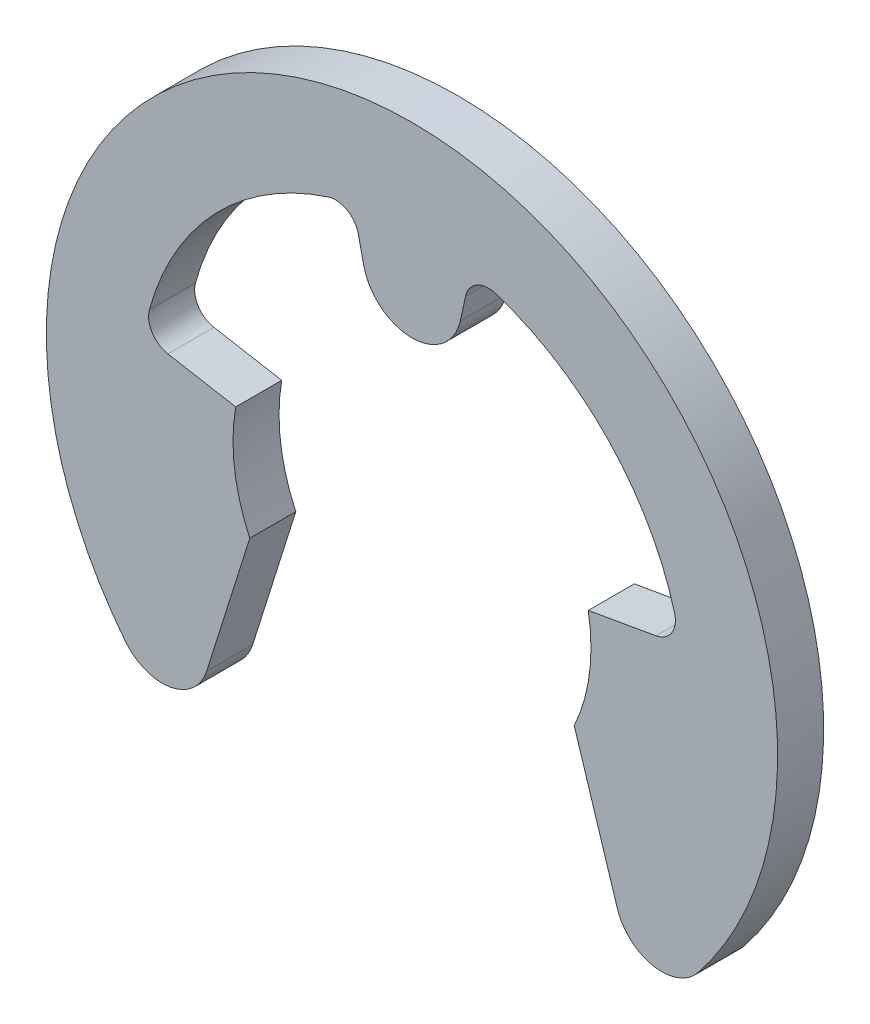
ISO-10303-21;
HEADER;
FILE_DESCRIPTION(('STEP AP214'),'2;1');
FILE_NAME('part.step','',(''),(''),'','','');
FILE_SCHEMA(('AUTOMOTIVE_DESIGN { 1 0 10303 214 1 1 1 1 }'));
ENDSEC;
DATA;
#1=APPLICATION_CONTEXT('core data for automotive mechanical design processes');
#2=APPLICATION_PROTOCOL_DEFINITION('international standard','automotive_design',2000,#1);
#3=PRODUCT_CONTEXT('',#1,'mechanical');
#4=PRODUCT('Part','Part','',(#3));
#5=PRODUCT_RELATED_PRODUCT_CATEGORY('part','',(#4));
#6=PRODUCT_DEFINITION_FORMATION('','',#4);
#7=PRODUCT_DEFINITION_CONTEXT('part definition',#1,'design');
#8=PRODUCT_DEFINITION('design','',#6,#7);
#9=PRODUCT_DEFINITION_SHAPE('','',#8);
#10=(LENGTH_UNIT() NAMED_UNIT(*) SI_UNIT(.MILLI.,.METRE.));
#11=(NAMED_UNIT(*) PLANE_ANGLE_UNIT() SI_UNIT($,.RADIAN.));
#12=(NAMED_UNIT(*) SI_UNIT($,.STERADIAN.) SOLID_ANGLE_UNIT());
#13=UNCERTAINTY_MEASURE_WITH_UNIT(LENGTH_MEASURE(1.E-05),#10,'distance_accuracy_value','');
#14=(GEOMETRIC_REPRESENTATION_CONTEXT(3) GLOBAL_UNCERTAINTY_ASSIGNED_CONTEXT((#13)) GLOBAL_UNIT_ASSIGNED_CONTEXT((#10,
#11,#12)) REPRESENTATION_CONTEXT('',''));
#15=CARTESIAN_POINT('',(0.,0.,0.));
#16=DIRECTION('',(0.,0.,1.));
#17=DIRECTION('',(1.,0.,0.));
#18=AXIS2_PLACEMENT_3D('',#15,#16,#17);
#19=CARTESIAN_POINT('',(0.,0.,-0.9));
#20=DIRECTION('',(0.,0.,1.));
#21=DIRECTION('',(1.,0.,0.));
#22=AXIS2_PLACEMENT_3D('',#19,#20,#21);
#23=CYLINDRICAL_SURFACE('',#22,3.5);
#24=CARTESIAN_POINT('',(0.,0.,0.));
#25=DIRECTION('',(0.,0.,-1.));
#26=DIRECTION('',(1.,0.,0.));
#27=AXIS2_PLACEMENT_3D('',#24,#25,#26);
#28=CIRCLE('',#27,3.5);
#29=CARTESIAN_POINT('',(3.44682713554273,0.607768621834246,0.));
#30=VERTEX_POINT('',#29);
#31=CARTESIAN_POINT('',(3.17207725462827,-1.47916391609246,0.));
#32=VERTEX_POINT('',#31);
#33=EDGE_CURVE('E191',#30,#32,#28,.T.);
#34=ORIENTED_EDGE('',*,*,#33,.F.);
#35=DIRECTION('',(0.,0.,1.));
#36=VECTOR('',#35,1.);
#37=CARTESIAN_POINT('',(3.44682713554273,0.607768621834246,-0.9));
#38=LINE('',#37,#36);
#39=CARTESIAN_POINT('',(3.44682713554273,0.607768621834246,-0.9));
#40=VERTEX_POINT('',#39);
#41=EDGE_CURVE('E11',#40,#30,#38,.T.);
#42=ORIENTED_EDGE('',*,*,#41,.F.);
#43=CARTESIAN_POINT('',(0.,0.,-0.9));
#44=DIRECTION('',(0.,0.,-1.));
#45=DIRECTION('',(1.,0.,0.));
#46=AXIS2_PLACEMENT_3D('',#43,#44,#45);
#47=CIRCLE('',#46,3.5);
#48=CARTESIAN_POINT('',(3.17207725462827,-1.47916391609246,-0.9));
#49=VERTEX_POINT('',#48);
#50=EDGE_CURVE('E241',#40,#49,#47,.T.);
#51=ORIENTED_EDGE('',*,*,#50,.T.);
#52=DIRECTION('',(0.,0.,1.));
#53=VECTOR('',#52,1.);
#54=CARTESIAN_POINT('',(3.17207725462827,-1.47916391609246,-0.9));
#55=LINE('',#54,#53);
#56=EDGE_CURVE('E37',#49,#32,#55,.T.);
#57=ORIENTED_EDGE('',*,*,#56,.T.);
#58=EDGE_LOOP('',(#34,#42,#51,#57));
#59=FACE_BOUND('',#58,.T.);
#60=ADVANCED_FACE('F34',(#59),#23,.F.);
#61=CARTESIAN_POINT('',(3.44682713554273,0.607768621834246,-0.9));
#62=DIRECTION('',(-0.173648177666928,0.984807753012208,0.));
#63=DIRECTION('',(-0.984807753012209,-0.173648177666928,0.));
#64=AXIS2_PLACEMENT_3D('',#61,#62,#63);
#65=PLANE('',#64);
#66=DIRECTION('',(-0.984807753012208,-0.173648177666928,0.));
#67=VECTOR('',#66,1.);
#68=CARTESIAN_POINT('',(3.44682713554273,0.607768621834246,0.));
#69=LINE('',#68,#67);
#70=CARTESIAN_POINT('',(4.7736835303089,0.84172920375708,0.));
#71=VERTEX_POINT('',#70);
#72=EDGE_CURVE('E239',#71,#30,#69,.T.);
#73=ORIENTED_EDGE('',*,*,#72,.F.);
#74=DIRECTION('',(0.,0.,1.));
#75=VECTOR('',#74,1.);
#76=CARTESIAN_POINT('',(4.7736835303089,0.84172920375708,-0.9));
#77=LINE('',#76,#75);
#78=CARTESIAN_POINT('',(4.7736835303089,0.84172920375708,-0.9));
#79=VERTEX_POINT('',#78);
#80=EDGE_CURVE('E43',#79,#71,#77,.T.);
#81=ORIENTED_EDGE('',*,*,#80,.F.);
#82=DIRECTION('',(-0.984807753012208,-0.173648177666928,0.));
#83=VECTOR('',#82,1.);
#84=CARTESIAN_POINT('',(3.44682713554273,0.607768621834246,-0.9));
#85=LINE('',#84,#83);
#86=EDGE_CURVE('E181',#79,#40,#85,.T.);
#87=ORIENTED_EDGE('',*,*,#86,.T.);
#88=ORIENTED_EDGE('',*,*,#41,.T.);
#89=EDGE_LOOP('',(#73,#81,#87,#88));
#90=FACE_BOUND('',#89,.T.);
#91=ADVANCED_FACE('F273',(#90),#65,.T.);
#92=CARTESIAN_POINT('',(4.69445654924837,1.2910477410689,-0.9));
#93=DIRECTION('',(0.,0.,1.));
#94=DIRECTION('',(1.,0.,0.));
#95=AXIS2_PLACEMENT_3D('',#92,#93,#94);
#96=CYLINDRICAL_SURFACE('',#95,0.456250000000001);
#97=CARTESIAN_POINT('',(4.69445654924837,1.2910477410689,0.));
#98=DIRECTION('',(0.,0.,-1.));
#99=DIRECTION('',(1.,0.,0.));
#100=AXIS2_PLACEMENT_3D('',#97,#98,#99);
#101=CIRCLE('',#100,0.456250000000001);
#102=CARTESIAN_POINT('',(5.13437353011503,1.41203167572619,0.));
#103=VERTEX_POINT('',#102);
#104=EDGE_CURVE('E168',#103,#71,#101,.T.);
#105=ORIENTED_EDGE('',*,*,#104,.F.);
#106=DIRECTION('',(0.,0.,1.));
#107=VECTOR('',#106,1.);
#108=CARTESIAN_POINT('',(5.13437353011503,1.41203167572619,-0.9));
#109=LINE('',#108,#107);
#110=CARTESIAN_POINT('',(5.13437353011503,1.41203167572619,-0.9));
#111=VERTEX_POINT('',#110);
#112=EDGE_CURVE('E163',#111,#103,#109,.T.);
#113=ORIENTED_EDGE('',*,*,#112,.F.);
#114=CARTESIAN_POINT('',(4.69445654924837,1.2910477410689,-0.9));
#115=DIRECTION('',(0.,0.,-1.));
#116=DIRECTION('',(1.,0.,0.));
#117=AXIS2_PLACEMENT_3D('',#114,#115,#116);
#118=CIRCLE('',#117,0.456250000000001);
#119=EDGE_CURVE('E166',#111,#79,#118,.T.);
#120=ORIENTED_EDGE('',*,*,#119,.T.);
#121=ORIENTED_EDGE('',*,*,#80,.T.);
#122=EDGE_LOOP('',(#105,#113,#120,#121));
#123=FACE_BOUND('',#122,.T.);
#124=ADVANCED_FACE('F165',(#123),#96,.F.);
#125=CARTESIAN_POINT('',(0.,0.,-0.9));
#126=DIRECTION('',(0.,0.,1.));
#127=DIRECTION('',(1.,0.,0.));
#128=AXIS2_PLACEMENT_3D('',#125,#126,#127);
#129=CYLINDRICAL_SURFACE('',#128,5.325);
#130=CARTESIAN_POINT('',(0.,0.,0.));
#131=DIRECTION('',(0.,0.,-1.));
#132=DIRECTION('',(1.,0.,0.));
#133=AXIS2_PLACEMENT_3D('',#130,#131,#132);
#134=CIRCLE('',#133,5.325);
#135=CARTESIAN_POINT('',(1.63464596233994,5.06789478756276,0.));
#136=VERTEX_POINT('',#135);
#137=EDGE_CURVE('E236',#136,#103,#134,.T.);
#138=ORIENTED_EDGE('',*,*,#137,.F.);
#139=DIRECTION('',(0.,0.,1.));
#140=VECTOR('',#139,1.);
#141=CARTESIAN_POINT('',(1.63464596233994,5.06789478756276,-0.9));
#142=LINE('',#141,#140);
#143=CARTESIAN_POINT('',(1.63464596233994,5.06789478756276,-0.9));
#144=VERTEX_POINT('',#143);
#145=EDGE_CURVE('E173',#144,#136,#142,.T.);
#146=ORIENTED_EDGE('',*,*,#145,.F.);
#147=CARTESIAN_POINT('',(0.,0.,-0.9));
#148=DIRECTION('',(0.,0.,-1.));
#149=DIRECTION('',(1.,0.,0.));
#150=AXIS2_PLACEMENT_3D('',#147,#148,#149);
#151=CIRCLE('',#150,5.325);
#152=EDGE_CURVE('E179',#144,#111,#151,.T.);
#153=ORIENTED_EDGE('',*,*,#152,.T.);
#154=ORIENTED_EDGE('',*,*,#112,.T.);
#155=EDGE_LOOP('',(#138,#146,#153,#154));
#156=FACE_BOUND('',#155,.T.);
#157=ADVANCED_FACE('F183',(#156),#129,.F.);
#158=CARTESIAN_POINT('',(1.49458826838358,4.63367375529505,-0.9));
#159=DIRECTION('',(0.,0.,1.));
#160=DIRECTION('',(1.,0.,0.));
#161=AXIS2_PLACEMENT_3D('',#158,#159,#160);
#162=CYLINDRICAL_SURFACE('',#161,0.45625);
#163=CARTESIAN_POINT('',(1.49458826838358,4.63367375529505,0.));
#164=DIRECTION('',(0.,0.,-1.));
#165=DIRECTION('',(1.,0.,0.));
#166=AXIS2_PLACEMENT_3D('',#163,#164,#165);
#167=CIRCLE('',#166,0.45625);
#168=CARTESIAN_POINT('',(1.04915321513511,4.73242432915431,0.));
#169=VERTEX_POINT('',#168);
#170=EDGE_CURVE('E233',#169,#136,#167,.T.);
#171=ORIENTED_EDGE('',*,*,#170,.F.);
#172=DIRECTION('',(0.,0.,1.));
#173=VECTOR('',#172,1.);
#174=CARTESIAN_POINT('',(1.04915321513511,4.73242432915431,-0.9));
#175=LINE('',#174,#173);
#176=CARTESIAN_POINT('',(1.04915321513511,4.73242432915431,-0.9));
#177=VERTEX_POINT('',#176);
#178=EDGE_CURVE('E245',#177,#169,#175,.T.);
#179=ORIENTED_EDGE('',*,*,#178,.F.);
#180=CARTESIAN_POINT('',(1.49458826838358,4.63367375529505,-0.9));
#181=DIRECTION('',(0.,0.,-1.));
#182=DIRECTION('',(1.,0.,0.));
#183=AXIS2_PLACEMENT_3D('',#180,#181,#182);
#184=CIRCLE('',#183,0.45625);
#185=EDGE_CURVE('E184',#177,#144,#184,.T.);
#186=ORIENTED_EDGE('',*,*,#185,.T.);
#187=ORIENTED_EDGE('',*,*,#145,.T.);
#188=EDGE_LOOP('',(#171,#179,#186,#187));
#189=FACE_BOUND('',#188,.T.);
#190=ADVANCED_FACE('F286',(#189),#162,.F.);
#191=CARTESIAN_POINT('',(0.943873594431308,4.25753864878336,-0.9));
#192=DIRECTION('',(0.976296007119933,-0.216439613938104,0.));
#193=DIRECTION('',(0.216439613938104,0.976296007119933,0.));
#194=AXIS2_PLACEMENT_3D('',#191,#192,#193);
#195=PLANE('',#194);
#196=DIRECTION('',(0.216439613938104,0.976296007119933,0.));
#197=VECTOR('',#196,1.);
#198=CARTESIAN_POINT('',(0.943873594431308,4.25753864878336,0.));
#199=LINE('',#198,#197);
#200=CARTESIAN_POINT('',(0.943873594431308,4.25753864878336,0.));
#201=VERTEX_POINT('',#200);
#202=EDGE_CURVE('E230',#201,#169,#199,.T.);
#203=ORIENTED_EDGE('',*,*,#202,.F.);
#204=DIRECTION('',(0.,0.,1.));
#205=VECTOR('',#204,1.);
#206=CARTESIAN_POINT('',(0.943873594431308,4.25753864878336,-0.9));
#207=LINE('',#206,#205);
#208=CARTESIAN_POINT('',(0.943873594431308,4.25753864878336,-0.9));
#209=VERTEX_POINT('',#208);
#210=EDGE_CURVE('E247',#209,#201,#207,.T.);
#211=ORIENTED_EDGE('',*,*,#210,.F.);
#212=DIRECTION('',(0.216439613938104,0.976296007119933,0.));
#213=VECTOR('',#212,1.);
#214=CARTESIAN_POINT('',(0.943873594431308,4.25753864878336,-0.9));
#215=LINE('',#214,#213);
#216=EDGE_CURVE('E186',#209,#177,#215,.T.);
#217=ORIENTED_EDGE('',*,*,#216,.T.);
#218=ORIENTED_EDGE('',*,*,#178,.T.);
#219=EDGE_LOOP('',(#203,#211,#217,#218));
#220=FACE_BOUND('',#219,.T.);
#221=ADVANCED_FACE('F289',(#220),#195,.T.);
#222=CARTESIAN_POINT('',(0.,4.46679038687838,-0.9));
#223=DIRECTION('',(0.,0.,1.));
#224=DIRECTION('',(1.,0.,0.));
#225=AXIS2_PLACEMENT_3D('',#222,#223,#224);
#226=CYLINDRICAL_SURFACE('',#225,0.96679038687839);
#227=CARTESIAN_POINT('',(0.,4.46679038687838,0.));
#228=DIRECTION('',(0.,0.,1.));
#229=DIRECTION('',(1.,0.,0.));
#230=AXIS2_PLACEMENT_3D('',#227,#228,#229);
#231=CIRCLE('',#230,0.96679038687839);
#232=CARTESIAN_POINT('',(-0.943873594431308,4.25753864878336,0.));
#233=VERTEX_POINT('',#232);
#234=EDGE_CURVE('E227',#233,#201,#231,.T.);
#235=ORIENTED_EDGE('',*,*,#234,.F.);
#236=DIRECTION('',(0.,0.,1.));
#237=VECTOR('',#236,1.);
#238=CARTESIAN_POINT('',(-0.943873594431308,4.25753864878336,-0.9));
#239=LINE('',#238,#237);
#240=CARTESIAN_POINT('',(-0.943873594431308,4.25753864878336,-0.9));
#241=VERTEX_POINT('',#240);
#242=EDGE_CURVE('E249',#241,#233,#239,.T.);
#243=ORIENTED_EDGE('',*,*,#242,.F.);
#244=CARTESIAN_POINT('',(0.,4.46679038687838,-0.9));
#245=DIRECTION('',(0.,0.,1.));
#246=DIRECTION('',(1.,0.,0.));
#247=AXIS2_PLACEMENT_3D('',#244,#245,#246);
#248=CIRCLE('',#247,0.96679038687839);
#249=EDGE_CURVE('E497',#241,#209,#248,.T.);
#250=ORIENTED_EDGE('',*,*,#249,.T.);
#251=ORIENTED_EDGE('',*,*,#210,.T.);
#252=EDGE_LOOP('',(#235,#243,#250,#251));
#253=FACE_BOUND('',#252,.T.);
#254=ADVANCED_FACE('F293',(#253),#226,.T.);
#255=CARTESIAN_POINT('',(-0.943873594431308,4.25753864878336,-0.9));
#256=DIRECTION('',(-0.976296007119933,-0.216439613938104,0.));
#257=DIRECTION('',(0.216439613938104,-0.976296007119933,0.));
#258=AXIS2_PLACEMENT_3D('',#255,#256,#257);
#259=PLANE('',#258);
#260=DIRECTION('',(0.216439613938104,-0.976296007119933,0.));
#261=VECTOR('',#260,1.);
#262=CARTESIAN_POINT('',(-0.943873594431308,4.25753864878336,0.));
#263=LINE('',#262,#261);
#264=CARTESIAN_POINT('',(-1.04915321513511,4.73242432915431,0.));
#265=VERTEX_POINT('',#264);
#266=EDGE_CURVE('E224',#265,#233,#263,.T.);
#267=ORIENTED_EDGE('',*,*,#266,.F.);
#268=DIRECTION('',(0.,0.,1.));
#269=VECTOR('',#268,1.);
#270=CARTESIAN_POINT('',(-1.04915321513511,4.73242432915431,-0.9));
#271=LINE('',#270,#269);
#272=CARTESIAN_POINT('',(-1.04915321513511,4.73242432915431,-0.9));
#273=VERTEX_POINT('',#272);
#274=EDGE_CURVE('E251',#273,#265,#271,.T.);
#275=ORIENTED_EDGE('',*,*,#274,.F.);
#276=DIRECTION('',(0.216439613938104,-0.976296007119933,0.));
#277=VECTOR('',#276,1.);
#278=CARTESIAN_POINT('',(-0.943873594431308,4.25753864878336,-0.9));
#279=LINE('',#278,#277);
#280=EDGE_CURVE('E501',#273,#241,#279,.T.);
#281=ORIENTED_EDGE('',*,*,#280,.T.);
#282=ORIENTED_EDGE('',*,*,#242,.T.);
#283=EDGE_LOOP('',(#267,#275,#281,#282));
#284=FACE_BOUND('',#283,.T.);
#285=ADVANCED_FACE('F297',(#284),#259,.T.);
#286=CARTESIAN_POINT('',(-1.49458826838358,4.63367375529505,-0.9));
#287=DIRECTION('',(0.,0.,1.));
#288=DIRECTION('',(1.,0.,0.));
#289=AXIS2_PLACEMENT_3D('',#286,#287,#288);
#290=CYLINDRICAL_SURFACE('',#289,0.45625);
#291=CARTESIAN_POINT('',(-1.49458826838358,4.63367375529505,0.));
#292=DIRECTION('',(0.,0.,-1.));
#293=DIRECTION('',(1.,0.,0.));
#294=AXIS2_PLACEMENT_3D('',#291,#292,#293);
#295=CIRCLE('',#294,0.45625);
#296=CARTESIAN_POINT('',(-1.63464596233994,5.06789478756276,0.));
#297=VERTEX_POINT('',#296);
#298=EDGE_CURVE('E221',#297,#265,#295,.T.);
#299=ORIENTED_EDGE('',*,*,#298,.F.);
#300=DIRECTION('',(0.,0.,1.));
#301=VECTOR('',#300,1.);
#302=CARTESIAN_POINT('',(-1.63464596233994,5.06789478756276,-0.9));
#303=LINE('',#302,#301);
#304=CARTESIAN_POINT('',(-1.63464596233994,5.06789478756276,-0.9));
#305=VERTEX_POINT('',#304);
#306=EDGE_CURVE('E253',#305,#297,#303,.T.);
#307=ORIENTED_EDGE('',*,*,#306,.F.);
#308=CARTESIAN_POINT('',(-1.49458826838358,4.63367375529505,-0.9));
#309=DIRECTION('',(0.,0.,-1.));
#310=DIRECTION('',(1.,0.,0.));
#311=AXIS2_PLACEMENT_3D('',#308,#309,#310);
#312=CIRCLE('',#311,0.45625);
#313=EDGE_CURVE('E490',#305,#273,#312,.T.);
#314=ORIENTED_EDGE('',*,*,#313,.T.);
#315=ORIENTED_EDGE('',*,*,#274,.T.);
#316=EDGE_LOOP('',(#299,#307,#314,#315));
#317=FACE_BOUND('',#316,.T.);
#318=ADVANCED_FACE('F301',(#317),#290,.F.);
#319=CARTESIAN_POINT('',(0.,0.,-0.9));
#320=DIRECTION('',(0.,0.,1.));
#321=DIRECTION('',(1.,0.,0.));
#322=AXIS2_PLACEMENT_3D('',#319,#320,#321);
#323=CYLINDRICAL_SURFACE('',#322,5.325);
#324=CARTESIAN_POINT('',(0.,0.,0.));
#325=DIRECTION('',(0.,0.,-1.));
#326=DIRECTION('',(1.,0.,0.));
#327=AXIS2_PLACEMENT_3D('',#324,#325,#326);
#328=CIRCLE('',#327,5.325);
#329=CARTESIAN_POINT('',(-5.13437353011503,1.41203167572619,0.));
#330=VERTEX_POINT('',#329);
#331=EDGE_CURVE('E218',#330,#297,#328,.T.);
#332=ORIENTED_EDGE('',*,*,#331,.F.);
#333=DIRECTION('',(0.,0.,1.));
#334=VECTOR('',#333,1.);
#335=CARTESIAN_POINT('',(-5.13437353011503,1.41203167572619,-0.9));
#336=LINE('',#335,#334);
#337=CARTESIAN_POINT('',(-5.13437353011503,1.41203167572619,-0.9));
#338=VERTEX_POINT('',#337);
#339=EDGE_CURVE('E255',#338,#330,#336,.T.);
#340=ORIENTED_EDGE('',*,*,#339,.F.);
#341=CARTESIAN_POINT('',(0.,0.,-0.9));
#342=DIRECTION('',(0.,0.,-1.));
#343=DIRECTION('',(1.,0.,0.));
#344=AXIS2_PLACEMENT_3D('',#341,#342,#343);
#345=CIRCLE('',#344,5.325);
#346=EDGE_CURVE('E486',#338,#305,#345,.T.);
#347=ORIENTED_EDGE('',*,*,#346,.T.);
#348=ORIENTED_EDGE('',*,*,#306,.T.);
#349=EDGE_LOOP('',(#332,#340,#347,#348));
#350=FACE_BOUND('',#349,.T.);
#351=ADVANCED_FACE('F305',(#350),#323,.F.);
#352=CARTESIAN_POINT('',(-4.69445654924837,1.2910477410689,-0.9));
#353=DIRECTION('',(0.,0.,1.));
#354=DIRECTION('',(1.,0.,0.));
#355=AXIS2_PLACEMENT_3D('',#352,#353,#354);
#356=CYLINDRICAL_SURFACE('',#355,0.456250000000001);
#357=CARTESIAN_POINT('',(-4.69445654924837,1.2910477410689,0.));
#358=DIRECTION('',(0.,0.,-1.));
#359=DIRECTION('',(1.,0.,0.));
#360=AXIS2_PLACEMENT_3D('',#357,#358,#359);
#361=CIRCLE('',#360,0.456250000000001);
#362=CARTESIAN_POINT('',(-4.7736835303089,0.841729203757079,0.));
#363=VERTEX_POINT('',#362);
#364=EDGE_CURVE('E215',#363,#330,#361,.T.);
#365=ORIENTED_EDGE('',*,*,#364,.F.);
#366=DIRECTION('',(0.,0.,1.));
#367=VECTOR('',#366,1.);
#368=CARTESIAN_POINT('',(-4.7736835303089,0.841729203757079,-0.9));
#369=LINE('',#368,#367);
#370=CARTESIAN_POINT('',(-4.7736835303089,0.841729203757079,-0.9));
#371=VERTEX_POINT('',#370);
#372=EDGE_CURVE('E257',#371,#363,#369,.T.);
#373=ORIENTED_EDGE('',*,*,#372,.F.);
#374=CARTESIAN_POINT('',(-4.69445654924837,1.2910477410689,-0.9));
#375=DIRECTION('',(0.,0.,-1.));
#376=DIRECTION('',(1.,0.,0.));
#377=AXIS2_PLACEMENT_3D('',#374,#375,#376);
#378=CIRCLE('',#377,0.456250000000001);
#379=EDGE_CURVE('E507',#371,#338,#378,.T.);
#380=ORIENTED_EDGE('',*,*,#379,.T.);
#381=ORIENTED_EDGE('',*,*,#339,.T.);
#382=EDGE_LOOP('',(#365,#373,#380,#381));
#383=FACE_BOUND('',#382,.T.);
#384=ADVANCED_FACE('F309',(#383),#356,.F.);
#385=CARTESIAN_POINT('',(-3.44682713554273,0.607768621834246,-0.9));
#386=DIRECTION('',(0.173648177666928,0.984807753012208,0.));
#387=DIRECTION('',(-0.984807753012209,0.173648177666928,0.));
#388=AXIS2_PLACEMENT_3D('',#385,#386,#387);
#389=PLANE('',#388);
#390=DIRECTION('',(-0.984807753012208,0.173648177666928,0.));
#391=VECTOR('',#390,1.);
#392=CARTESIAN_POINT('',(-3.44682713554273,0.607768621834246,0.));
#393=LINE('',#392,#391);
#394=CARTESIAN_POINT('',(-3.44682713554273,0.607768621834246,0.));
#395=VERTEX_POINT('',#394);
#396=EDGE_CURVE('E212',#395,#363,#393,.T.);
#397=ORIENTED_EDGE('',*,*,#396,.F.);
#398=DIRECTION('',(0.,0.,1.));
#399=VECTOR('',#398,1.);
#400=CARTESIAN_POINT('',(-3.44682713554273,0.607768621834246,-0.9));
#401=LINE('',#400,#399);
#402=CARTESIAN_POINT('',(-3.44682713554273,0.607768621834246,-0.9));
#403=VERTEX_POINT('',#402);
#404=EDGE_CURVE('E259',#403,#395,#401,.T.);
#405=ORIENTED_EDGE('',*,*,#404,.F.);
#406=DIRECTION('',(-0.984807753012208,0.173648177666928,0.));
#407=VECTOR('',#406,1.);
#408=CARTESIAN_POINT('',(-3.44682713554273,0.607768621834246,-0.9));
#409=LINE('',#408,#407);
#410=EDGE_CURVE('E479',#403,#371,#409,.T.);
#411=ORIENTED_EDGE('',*,*,#410,.T.);
#412=ORIENTED_EDGE('',*,*,#372,.T.);
#413=EDGE_LOOP('',(#397,#405,#411,#412));
#414=FACE_BOUND('',#413,.T.);
#415=ADVANCED_FACE('F313',(#414),#389,.T.);
#416=CARTESIAN_POINT('',(0.,0.,-0.9));
#417=DIRECTION('',(0.,0.,1.));
#418=DIRECTION('',(1.,0.,0.));
#419=AXIS2_PLACEMENT_3D('',#416,#417,#418);
#420=CYLINDRICAL_SURFACE('',#419,3.5);
#421=CARTESIAN_POINT('',(0.,0.,0.));
#422=DIRECTION('',(0.,0.,-1.));
#423=DIRECTION('',(1.,0.,0.));
#424=AXIS2_PLACEMENT_3D('',#421,#422,#423);
#425=CIRCLE('',#424,3.5);
#426=CARTESIAN_POINT('',(-3.17207725462827,-1.47916391609246,0.));
#427=VERTEX_POINT('',#426);
#428=EDGE_CURVE('E209',#427,#395,#425,.T.);
#429=ORIENTED_EDGE('',*,*,#428,.F.);
#430=DIRECTION('',(0.,0.,1.));
#431=VECTOR('',#430,1.);
#432=CARTESIAN_POINT('',(-3.17207725462827,-1.47916391609246,-0.9));
#433=LINE('',#432,#431);
#434=CARTESIAN_POINT('',(-3.17207725462827,-1.47916391609246,-0.9));
#435=VERTEX_POINT('',#434);
#436=EDGE_CURVE('E261',#435,#427,#433,.T.);
#437=ORIENTED_EDGE('',*,*,#436,.F.);
#438=CARTESIAN_POINT('',(0.,0.,-0.9));
#439=DIRECTION('',(0.,0.,-1.));
#440=DIRECTION('',(1.,0.,0.));
#441=AXIS2_PLACEMENT_3D('',#438,#439,#440);
#442=CIRCLE('',#441,3.5);
#443=EDGE_CURVE('E475',#435,#403,#442,.T.);
#444=ORIENTED_EDGE('',*,*,#443,.T.);
#445=ORIENTED_EDGE('',*,*,#404,.T.);
#446=EDGE_LOOP('',(#429,#437,#444,#445));
#447=FACE_BOUND('',#446,.T.);
#448=ADVANCED_FACE('F317',(#447),#420,.F.);
#449=CARTESIAN_POINT('',(-3.17207725462827,-1.47916391609246,-0.9));
#450=DIRECTION('',(0.953716950748227,-0.300705799504273,0.));
#451=DIRECTION('',(0.300705799504273,0.953716950748227,0.));
#452=AXIS2_PLACEMENT_3D('',#449,#450,#451);
#453=PLANE('',#452);
#454=DIRECTION('',(0.300705799504273,0.953716950748227,0.));
#455=VECTOR('',#454,1.);
#456=CARTESIAN_POINT('',(-3.17207725462827,-1.47916391609246,0.));
#457=LINE('',#456,#455);
#458=CARTESIAN_POINT('',(-4.01500875403962,-4.15260107837372,0.));
#459=VERTEX_POINT('',#458);
#460=EDGE_CURVE('E206',#459,#427,#457,.T.);
#461=ORIENTED_EDGE('',*,*,#460,.F.);
#462=DIRECTION('',(0.,0.,1.));
#463=VECTOR('',#462,1.);
#464=CARTESIAN_POINT('',(-4.01500875403962,-4.15260107837372,-0.9));
#465=LINE('',#464,#463);
#466=CARTESIAN_POINT('',(-4.01500875403962,-4.15260107837372,-0.9));
#467=VERTEX_POINT('',#466);
#468=EDGE_CURVE('E263',#467,#459,#465,.T.);
#469=ORIENTED_EDGE('',*,*,#468,.F.);
#470=DIRECTION('',(0.300705799504273,0.953716950748227,0.));
#471=VECTOR('',#470,1.);
#472=CARTESIAN_POINT('',(-3.17207725462827,-1.47916391609246,-0.9));
#473=LINE('',#472,#471);
#474=EDGE_CURVE('E511',#467,#435,#473,.T.);
#475=ORIENTED_EDGE('',*,*,#474,.T.);
#476=ORIENTED_EDGE('',*,*,#436,.T.);
#477=EDGE_LOOP('',(#461,#469,#475,#476));
#478=FACE_BOUND('',#477,.T.);
#479=ADVANCED_FACE('F321',(#478),#453,.T.);
#480=CARTESIAN_POINT('',(-4.88527547159737,-3.87820703632607,-0.9));
#481=DIRECTION('',(0.,0.,1.));
#482=DIRECTION('',(1.,0.,0.));
#483=AXIS2_PLACEMENT_3D('',#480,#481,#482);
#484=CYLINDRICAL_SURFACE('',#483,0.9125);
#485=CARTESIAN_POINT('',(-4.88527547159737,-3.87820703632607,0.));
#486=DIRECTION('',(0.,0.,1.));
#487=DIRECTION('',(1.,0.,0.));
#488=AXIS2_PLACEMENT_3D('',#485,#486,#487);
#489=CIRCLE('',#488,0.9125);
#490=CARTESIAN_POINT('',(-5.59995504960661,-4.44555996949602,0.));
#491=VERTEX_POINT('',#490);
#492=EDGE_CURVE('E203',#491,#459,#489,.T.);
#493=ORIENTED_EDGE('',*,*,#492,.F.);
#494=DIRECTION('',(0.,0.,1.));
#495=VECTOR('',#494,1.);
#496=CARTESIAN_POINT('',(-5.59995504960661,-4.44555996949602,-0.9));
#497=LINE('',#496,#495);
#498=CARTESIAN_POINT('',(-5.59995504960661,-4.44555996949602,-0.9));
#499=VERTEX_POINT('',#498);
#500=EDGE_CURVE('E265',#499,#491,#497,.T.);
#501=ORIENTED_EDGE('',*,*,#500,.F.);
#502=CARTESIAN_POINT('',(-4.88527547159737,-3.87820703632607,-0.9));
#503=DIRECTION('',(0.,0.,1.));
#504=DIRECTION('',(1.,0.,0.));
#505=AXIS2_PLACEMENT_3D('',#502,#503,#504);
#506=CIRCLE('',#505,0.9125);
#507=EDGE_CURVE('E468',#499,#467,#506,.T.);
#508=ORIENTED_EDGE('',*,*,#507,.T.);
#509=ORIENTED_EDGE('',*,*,#468,.T.);
#510=EDGE_LOOP('',(#493,#501,#508,#509));
#511=FACE_BOUND('',#510,.T.);
#512=ADVANCED_FACE('F325',(#511),#484,.T.);
#513=CARTESIAN_POINT('',(0.,0.,-0.9));
#514=DIRECTION('',(0.,0.,1.));
#515=DIRECTION('',(1.,0.,0.));
#516=AXIS2_PLACEMENT_3D('',#513,#514,#515);
#517=CYLINDRICAL_SURFACE('',#516,7.15);
#518=CARTESIAN_POINT('',(0.,0.,0.));
#519=DIRECTION('',(0.,0.,1.));
#520=DIRECTION('',(1.,0.,0.));
#521=AXIS2_PLACEMENT_3D('',#518,#519,#520);
#522=CIRCLE('',#521,7.15);
#523=CARTESIAN_POINT('',(5.59995504960661,-4.44555996949602,0.));
#524=VERTEX_POINT('',#523);
#525=EDGE_CURVE('E200',#524,#491,#522,.T.);
#526=ORIENTED_EDGE('',*,*,#525,.F.);
#527=DIRECTION('',(0.,0.,1.));
#528=VECTOR('',#527,1.);
#529=CARTESIAN_POINT('',(5.59995504960661,-4.44555996949602,-0.9));
#530=LINE('',#529,#528);
#531=CARTESIAN_POINT('',(5.59995504960661,-4.44555996949602,-0.9));
#532=VERTEX_POINT('',#531);
#533=EDGE_CURVE('E267',#532,#524,#530,.T.);
#534=ORIENTED_EDGE('',*,*,#533,.F.);
#535=CARTESIAN_POINT('',(0.,0.,-0.9));
#536=DIRECTION('',(0.,0.,1.));
#537=DIRECTION('',(1.,0.,0.));
#538=AXIS2_PLACEMENT_3D('',#535,#536,#537);
#539=CIRCLE('',#538,7.15);
#540=EDGE_CURVE('E464',#532,#499,#539,.T.);
#541=ORIENTED_EDGE('',*,*,#540,.T.);
#542=ORIENTED_EDGE('',*,*,#500,.T.);
#543=EDGE_LOOP('',(#526,#534,#541,#542));
#544=FACE_BOUND('',#543,.T.);
#545=ADVANCED_FACE('F329',(#544),#517,.T.);
#546=CARTESIAN_POINT('',(4.88527547159737,-3.87820703632607,-0.9));
#547=DIRECTION('',(0.,0.,1.));
#548=DIRECTION('',(1.,0.,0.));
#549=AXIS2_PLACEMENT_3D('',#546,#547,#548);
#550=CYLINDRICAL_SURFACE('',#549,0.9125);
#551=CARTESIAN_POINT('',(4.88527547159737,-3.87820703632607,0.));
#552=DIRECTION('',(0.,0.,1.));
#553=DIRECTION('',(1.,0.,0.));
#554=AXIS2_PLACEMENT_3D('',#551,#552,#553);
#555=CIRCLE('',#554,0.9125);
#556=CARTESIAN_POINT('',(4.01500875403962,-4.15260107837372,0.));
#557=VERTEX_POINT('',#556);
#558=EDGE_CURVE('E197',#557,#524,#555,.T.);
#559=ORIENTED_EDGE('',*,*,#558,.F.);
#560=DIRECTION('',(0.,0.,1.));
#561=VECTOR('',#560,1.);
#562=CARTESIAN_POINT('',(4.01500875403962,-4.15260107837372,-0.9));
#563=LINE('',#562,#561);
#564=CARTESIAN_POINT('',(4.01500875403962,-4.15260107837372,-0.9));
#565=VERTEX_POINT('',#564);
#566=EDGE_CURVE('E268',#565,#557,#563,.T.);
#567=ORIENTED_EDGE('',*,*,#566,.F.);
#568=CARTESIAN_POINT('',(4.88527547159737,-3.87820703632607,-0.9));
#569=DIRECTION('',(0.,0.,1.));
#570=DIRECTION('',(1.,0.,0.));
#571=AXIS2_PLACEMENT_3D('',#568,#569,#570);
#572=CIRCLE('',#571,0.9125);
#573=EDGE_CURVE('E515',#565,#532,#572,.T.);
#574=ORIENTED_EDGE('',*,*,#573,.T.);
#575=ORIENTED_EDGE('',*,*,#533,.T.);
#576=EDGE_LOOP('',(#559,#567,#574,#575));
#577=FACE_BOUND('',#576,.T.);
#578=ADVANCED_FACE('F333',(#577),#550,.T.);
#579=CARTESIAN_POINT('',(3.17207725462827,-1.47916391609246,-0.9));
#580=DIRECTION('',(-0.953716950748227,-0.300705799504273,0.));
#581=DIRECTION('',(0.300705799504273,-0.953716950748227,0.));
#582=AXIS2_PLACEMENT_3D('',#579,#580,#581);
#583=PLANE('',#582);
#584=DIRECTION('',(0.300705799504273,-0.953716950748227,0.));
#585=VECTOR('',#584,1.);
#586=CARTESIAN_POINT('',(3.17207725462827,-1.47916391609246,0.));
#587=LINE('',#586,#585);
#588=EDGE_CURVE('E194',#32,#557,#587,.T.);
#589=ORIENTED_EDGE('',*,*,#588,.F.);
#590=ORIENTED_EDGE('',*,*,#56,.F.);
#591=DIRECTION('',(0.300705799504273,-0.953716950748227,0.));
#592=VECTOR('',#591,1.);
#593=CARTESIAN_POINT('',(3.17207725462827,-1.47916391609246,-0.9));
#594=LINE('',#593,#592);
#595=EDGE_CURVE('E517',#49,#565,#594,.T.);
#596=ORIENTED_EDGE('',*,*,#595,.T.);
#597=ORIENTED_EDGE('',*,*,#566,.T.);
#598=EDGE_LOOP('',(#589,#590,#596,#597));
#599=FACE_BOUND('',#598,.T.);
#600=ADVANCED_FACE('F270',(#599),#583,.T.);
#601=CARTESIAN_POINT('',(0.,0.,-0.9));
#602=DIRECTION('',(0.,0.,1.));
#603=DIRECTION('',(1.,0.,0.));
#604=AXIS2_PLACEMENT_3D('',#601,#602,#603);
#605=PLANE('',#604);
#606=ORIENTED_EDGE('',*,*,#50,.F.);
#607=ORIENTED_EDGE('',*,*,#86,.F.);
#608=ORIENTED_EDGE('',*,*,#119,.F.);
#609=ORIENTED_EDGE('',*,*,#152,.F.);
#610=ORIENTED_EDGE('',*,*,#185,.F.);
#611=ORIENTED_EDGE('',*,*,#216,.F.);
#612=ORIENTED_EDGE('',*,*,#249,.F.);
#613=ORIENTED_EDGE('',*,*,#280,.F.);
#614=ORIENTED_EDGE('',*,*,#313,.F.);
#615=ORIENTED_EDGE('',*,*,#346,.F.);
#616=ORIENTED_EDGE('',*,*,#379,.F.);
#617=ORIENTED_EDGE('',*,*,#410,.F.);
#618=ORIENTED_EDGE('',*,*,#443,.F.);
#619=ORIENTED_EDGE('',*,*,#474,.F.);
#620=ORIENTED_EDGE('',*,*,#507,.F.);
#621=ORIENTED_EDGE('',*,*,#540,.F.);
#622=ORIENTED_EDGE('',*,*,#573,.F.);
#623=ORIENTED_EDGE('',*,*,#595,.F.);
#624=EDGE_LOOP('',(#606,#607,#608,#609,#610,#611,#612,#613,#614,#615,#616,#617,#618,#619,#620,
#621,#622,#623));
#625=FACE_BOUND('',#624,.T.);
#626=ADVANCED_FACE('F177',(#625),#605,.F.);
#627=CARTESIAN_POINT('',(0.,0.,0.));
#628=DIRECTION('',(0.,0.,1.));
#629=DIRECTION('',(1.,0.,0.));
#630=AXIS2_PLACEMENT_3D('',#627,#628,#629);
#631=PLANE('',#630);
#632=ORIENTED_EDGE('',*,*,#33,.T.);
#633=ORIENTED_EDGE('',*,*,#588,.T.);
#634=ORIENTED_EDGE('',*,*,#558,.T.);
#635=ORIENTED_EDGE('',*,*,#525,.T.);
#636=ORIENTED_EDGE('',*,*,#492,.T.);
#637=ORIENTED_EDGE('',*,*,#460,.T.);
#638=ORIENTED_EDGE('',*,*,#428,.T.);
#639=ORIENTED_EDGE('',*,*,#396,.T.);
#640=ORIENTED_EDGE('',*,*,#364,.T.);
#641=ORIENTED_EDGE('',*,*,#331,.T.);
#642=ORIENTED_EDGE('',*,*,#298,.T.);
#643=ORIENTED_EDGE('',*,*,#266,.T.);
#644=ORIENTED_EDGE('',*,*,#234,.T.);
#645=ORIENTED_EDGE('',*,*,#202,.T.);
#646=ORIENTED_EDGE('',*,*,#170,.T.);
#647=ORIENTED_EDGE('',*,*,#137,.T.);
#648=ORIENTED_EDGE('',*,*,#104,.T.);
#649=ORIENTED_EDGE('',*,*,#72,.T.);
#650=EDGE_LOOP('',(#632,#633,#634,#635,#636,#637,#638,#639,#640,#641,#642,#643,#644,#645,#646,
#647,#648,#649));
#651=FACE_BOUND('',#650,.T.);
#652=ADVANCED_FACE('F272',(#651),#631,.T.);
#653=CLOSED_SHELL('',(#60,#91,#124,#157,#190,#221,#254,#285,#318,#351,#384,#415,#448,#479,#512,
#545,#578,#600,#626,#652));
#654=MANIFOLD_SOLID_BREP('B2',#653);
#655=ADVANCED_BREP_SHAPE_REPRESENTATION('',(#18,#654),#14);
#656=SHAPE_DEFINITION_REPRESENTATION(#9,#655);
ENDSEC;
END-ISO-10303-21;
